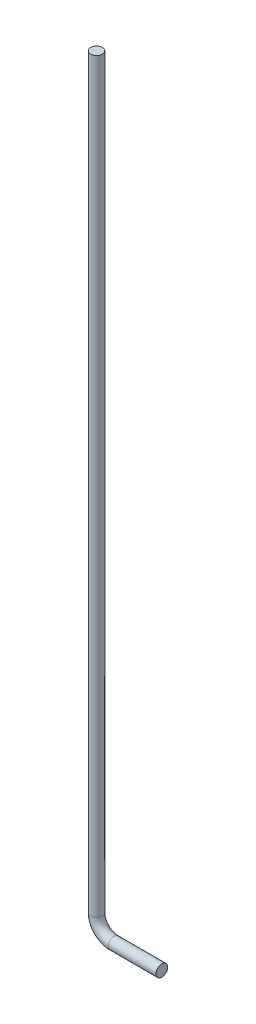
ISO-10303-21;
HEADER;
FILE_DESCRIPTION(('STEP AP214'),'2;1');
FILE_NAME('part.step','',(''),(''),'','','');
FILE_SCHEMA(('AUTOMOTIVE_DESIGN { 1 0 10303 214 1 1 1 1 }'));
ENDSEC;
DATA;
#1=APPLICATION_CONTEXT('core data for automotive mechanical design processes');
#2=APPLICATION_PROTOCOL_DEFINITION('international standard','automotive_design',2000,#1);
#3=PRODUCT_CONTEXT('',#1,'mechanical');
#4=PRODUCT('Part','Part','',(#3));
#5=PRODUCT_RELATED_PRODUCT_CATEGORY('part','',(#4));
#6=PRODUCT_DEFINITION_FORMATION('','',#4);
#7=PRODUCT_DEFINITION_CONTEXT('part definition',#1,'design');
#8=PRODUCT_DEFINITION('design','',#6,#7);
#9=PRODUCT_DEFINITION_SHAPE('','',#8);
#10=(LENGTH_UNIT() NAMED_UNIT(*) SI_UNIT(.MILLI.,.METRE.));
#11=(NAMED_UNIT(*) PLANE_ANGLE_UNIT() SI_UNIT($,.RADIAN.));
#12=(NAMED_UNIT(*) SI_UNIT($,.STERADIAN.) SOLID_ANGLE_UNIT());
#13=UNCERTAINTY_MEASURE_WITH_UNIT(LENGTH_MEASURE(1.E-05),#10,'distance_accuracy_value','');
#14=(GEOMETRIC_REPRESENTATION_CONTEXT(3) GLOBAL_UNCERTAINTY_ASSIGNED_CONTEXT((#13)) GLOBAL_UNIT_ASSIGNED_CONTEXT((#10,
#11,#12)) REPRESENTATION_CONTEXT('',''));
#15=CARTESIAN_POINT('',(0.,0.,0.));
#16=DIRECTION('',(0.,0.,1.));
#17=DIRECTION('',(1.,0.,0.));
#18=AXIS2_PLACEMENT_3D('',#15,#16,#17);
#19=CARTESIAN_POINT('',(-12.7,-203.2,0.));
#20=DIRECTION('',(0.,1.,0.));
#21=DIRECTION('',(0.,0.,1.));
#22=AXIS2_PLACEMENT_3D('',#19,#20,#21);
#23=CYLINDRICAL_SURFACE('',#22,1.5875);
#24=CARTESIAN_POINT('',(-12.7,-203.2,0.));
#25=DIRECTION('',(0.,-1.,0.));
#26=DIRECTION('',(0.,0.,-1.));
#27=AXIS2_PLACEMENT_3D('',#24,#25,#26);
#28=CIRCLE('',#27,1.58749999999999);
#29=CARTESIAN_POINT('',(-14.2875,-203.2,0.));
#30=VERTEX_POINT('',#29);
#31=EDGE_CURVE('E60',#30,#30,#28,.T.);
#32=ORIENTED_EDGE('',*,*,#31,.F.);
#33=EDGE_LOOP('',(#32));
#34=FACE_BOUND('',#33,.T.);
#35=CARTESIAN_POINT('',(-12.7,0.,0.));
#36=DIRECTION('',(0.,1.,0.));
#37=DIRECTION('',(0.,0.,1.));
#38=AXIS2_PLACEMENT_3D('',#35,#36,#37);
#39=CIRCLE('',#38,1.5875);
#40=CARTESIAN_POINT('',(-12.7,0.,1.5875));
#41=VERTEX_POINT('',#40);
#42=EDGE_CURVE('E10',#41,#41,#39,.T.);
#43=ORIENTED_EDGE('',*,*,#42,.F.);
#44=EDGE_LOOP('',(#43));
#45=FACE_BOUND('',#44,.T.);
#46=ADVANCED_FACE('F43',(#34,#45),#23,.T.);
#47=CARTESIAN_POINT('',(-12.7,0.,0.));
#48=DIRECTION('',(0.,1.,0.));
#49=DIRECTION('',(0.,0.,1.));
#50=AXIS2_PLACEMENT_3D('',#47,#48,#49);
#51=PLANE('',#50);
#52=ORIENTED_EDGE('',*,*,#42,.T.);
#53=EDGE_LOOP('',(#52));
#54=FACE_BOUND('',#53,.T.);
#55=ADVANCED_FACE('F71',(#54),#51,.T.);
#56=CARTESIAN_POINT('',(5.08,-207.9625,0.));
#57=DIRECTION('',(1.,0.,0.));
#58=DIRECTION('',(0.,0.,-1.));
#59=AXIS2_PLACEMENT_3D('',#56,#57,#58);
#60=PLANE('',#59);
#61=CARTESIAN_POINT('',(5.08,-207.9625,0.));
#62=DIRECTION('',(1.,0.,0.));
#63=DIRECTION('',(0.,0.,-1.));
#64=AXIS2_PLACEMENT_3D('',#61,#62,#63);
#65=CIRCLE('',#64,1.58749999999999);
#66=CARTESIAN_POINT('',(5.08,-207.9625,-1.58749999999999));
#67=VERTEX_POINT('',#66);
#68=EDGE_CURVE('E50',#67,#67,#65,.T.);
#69=ORIENTED_EDGE('',*,*,#68,.T.);
#70=EDGE_LOOP('',(#69));
#71=FACE_BOUND('',#70,.T.);
#72=ADVANCED_FACE('F75',(#71),#60,.T.);
#73=CARTESIAN_POINT('',(-7.93749999999999,-203.2,0.));
#74=DIRECTION('',(0.,0.,1.));
#75=DIRECTION('',(1.,0.,0.));
#76=AXIS2_PLACEMENT_3D('',#73,#74,#75);
#77=TOROIDAL_SURFACE('',#76,4.76250000000003,1.58749999999999);
#78=CARTESIAN_POINT('',(-7.93749999999991,-207.9625,0.));
#79=DIRECTION('',(1.,0.,0.));
#80=DIRECTION('',(0.,0.,-1.));
#81=AXIS2_PLACEMENT_3D('',#78,#79,#80);
#82=CIRCLE('',#81,1.58749999999999);
#83=CARTESIAN_POINT('',(-7.93749999999988,-209.55,0.));
#84=VERTEX_POINT('',#83);
#85=EDGE_CURVE('E55',#84,#84,#82,.T.);
#86=CARTESIAN_POINT('',(-7.93749999999999,-203.2,0.));
#87=DIRECTION('',(0.,0.,1.));
#88=DIRECTION('',(1.,0.,0.));
#89=AXIS2_PLACEMENT_3D('',#86,#87,#88);
#90=CIRCLE('',#89,6.35000000000002);
#91=EDGE_CURVE('',#30,#84,#90,.T.);
#92=ORIENTED_EDGE('',*,*,#31,.T.);
#93=ORIENTED_EDGE('',*,*,#85,.F.);
#94=ORIENTED_EDGE('',*,*,#91,.T.);
#95=ORIENTED_EDGE('',*,*,#91,.F.);
#96=EDGE_LOOP('',(#92,#94,#93,#95));
#97=FACE_BOUND('',#96,.T.);
#98=ADVANCED_FACE('F67',(#97),#77,.T.);
#99=CARTESIAN_POINT('',(-7.93749999999998,-207.9625,0.));
#100=DIRECTION('',(1.,0.,0.));
#101=DIRECTION('',(0.,1.,0.));
#102=AXIS2_PLACEMENT_3D('',#99,#100,#101);
#103=CYLINDRICAL_SURFACE('',#102,1.58749999999999);
#104=ORIENTED_EDGE('',*,*,#68,.F.);
#105=EDGE_LOOP('',(#104));
#106=FACE_BOUND('',#105,.T.);
#107=ORIENTED_EDGE('',*,*,#85,.T.);
#108=EDGE_LOOP('',(#107));
#109=FACE_BOUND('',#108,.T.);
#110=ADVANCED_FACE('F76',(#106,#109),#103,.T.);
#111=CLOSED_SHELL('',(#46,#55,#72,#98,#110));
#112=MANIFOLD_SOLID_BREP('B2',#111);
#113=ADVANCED_BREP_SHAPE_REPRESENTATION('',(#18,#112),#14);
#114=SHAPE_DEFINITION_REPRESENTATION(#9,#113);
ENDSEC;
END-ISO-10303-21;
